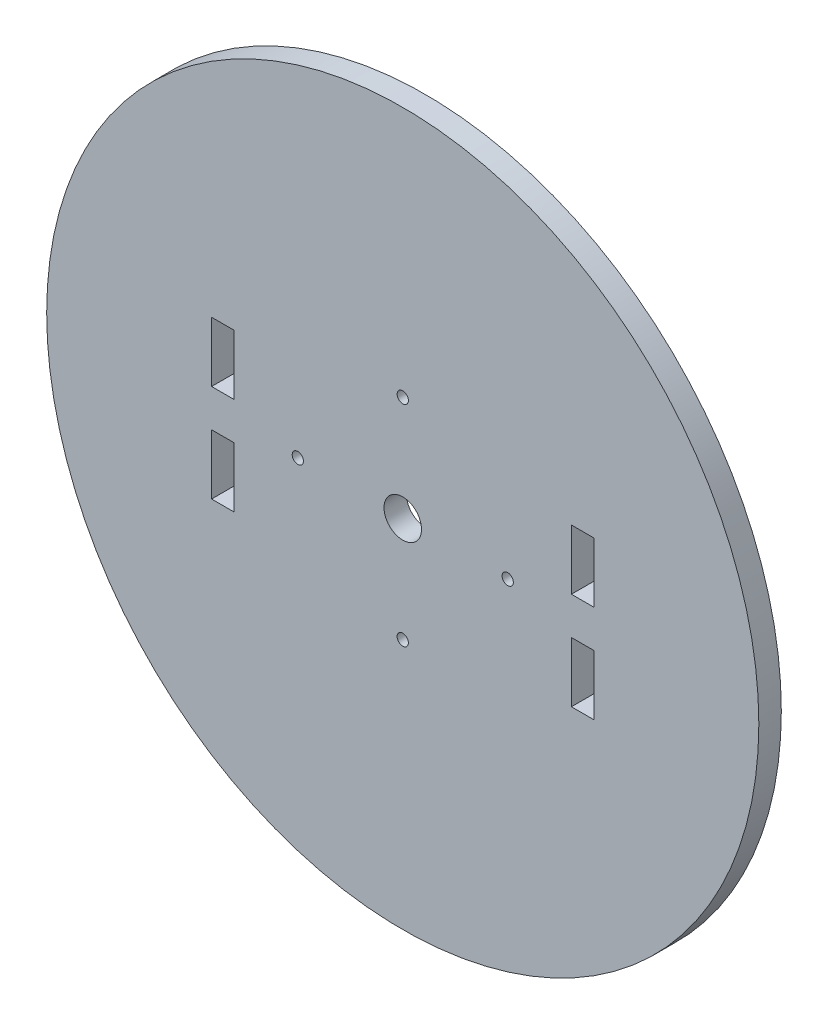
ISO-10303-21;
HEADER;
FILE_DESCRIPTION(('STEP AP214'),'2;1');
FILE_NAME('part.step','',(''),(''),'','','');
FILE_SCHEMA(('AUTOMOTIVE_DESIGN { 1 0 10303 214 1 1 1 1 }'));
ENDSEC;
DATA;
#1=APPLICATION_CONTEXT('core data for automotive mechanical design processes');
#2=APPLICATION_PROTOCOL_DEFINITION('international standard','automotive_design',2000,#1);
#3=PRODUCT_CONTEXT('',#1,'mechanical');
#4=PRODUCT('Part','Part','',(#3));
#5=PRODUCT_RELATED_PRODUCT_CATEGORY('part','',(#4));
#6=PRODUCT_DEFINITION_FORMATION('','',#4);
#7=PRODUCT_DEFINITION_CONTEXT('part definition',#1,'design');
#8=PRODUCT_DEFINITION('design','',#6,#7);
#9=PRODUCT_DEFINITION_SHAPE('','',#8);
#10=(LENGTH_UNIT() NAMED_UNIT(*) SI_UNIT(.MILLI.,.METRE.));
#11=(NAMED_UNIT(*) PLANE_ANGLE_UNIT() SI_UNIT($,.RADIAN.));
#12=(NAMED_UNIT(*) SI_UNIT($,.STERADIAN.) SOLID_ANGLE_UNIT());
#13=UNCERTAINTY_MEASURE_WITH_UNIT(LENGTH_MEASURE(1.E-05),#10,'distance_accuracy_value','');
#14=(GEOMETRIC_REPRESENTATION_CONTEXT(3) GLOBAL_UNCERTAINTY_ASSIGNED_CONTEXT((#13)) GLOBAL_UNIT_ASSIGNED_CONTEXT((#10,
#11,#12)) REPRESENTATION_CONTEXT('',''));
#15=CARTESIAN_POINT('',(0.,0.,0.));
#16=DIRECTION('',(0.,0.,1.));
#17=DIRECTION('',(1.,0.,0.));
#18=AXIS2_PLACEMENT_3D('',#15,#16,#17);
#19=CARTESIAN_POINT('',(0.,0.,3.));
#20=DIRECTION('',(0.,0.,1.));
#21=DIRECTION('',(1.,0.,0.));
#22=AXIS2_PLACEMENT_3D('',#19,#20,#21);
#23=PLANE('',#22);
#24=DIRECTION('',(-1.,0.,0.));
#25=VECTOR('',#24,1.);
#26=CARTESIAN_POINT('',(-22.5,10.5,3.));
#27=LINE('',#26,#25);
#28=CARTESIAN_POINT('',(-22.5,10.5,3.));
#29=VERTEX_POINT('',#28);
#30=CARTESIAN_POINT('',(-25.5,10.5,3.));
#31=VERTEX_POINT('',#30);
#32=EDGE_CURVE('E54',#29,#31,#27,.T.);
#33=ORIENTED_EDGE('',*,*,#32,.F.);
#34=DIRECTION('',(0.,1.,0.));
#35=VECTOR('',#34,1.);
#36=CARTESIAN_POINT('',(-22.5,10.5,3.));
#37=LINE('',#36,#35);
#38=CARTESIAN_POINT('',(-22.5,2.5,3.));
#39=VERTEX_POINT('',#38);
#40=EDGE_CURVE('E256',#39,#29,#37,.T.);
#41=ORIENTED_EDGE('',*,*,#40,.F.);
#42=DIRECTION('',(1.,0.,0.));
#43=VECTOR('',#42,1.);
#44=CARTESIAN_POINT('',(-22.5,2.5,3.));
#45=LINE('',#44,#43);
#46=CARTESIAN_POINT('',(-25.5,2.5,3.));
#47=VERTEX_POINT('',#46);
#48=EDGE_CURVE('E275',#47,#39,#45,.T.);
#49=ORIENTED_EDGE('',*,*,#48,.F.);
#50=DIRECTION('',(0.,-1.,0.));
#51=VECTOR('',#50,1.);
#52=CARTESIAN_POINT('',(-25.5,10.5,3.));
#53=LINE('',#52,#51);
#54=EDGE_CURVE('E271',#31,#47,#53,.T.);
#55=ORIENTED_EDGE('',*,*,#54,.F.);
#56=EDGE_LOOP('',(#33,#41,#49,#55));
#57=FACE_BOUND('',#56,.T.);
#58=DIRECTION('',(-1.,0.,0.));
#59=VECTOR('',#58,1.);
#60=CARTESIAN_POINT('',(-22.5,-2.5,3.));
#61=LINE('',#60,#59);
#62=CARTESIAN_POINT('',(-22.5,-2.5,3.));
#63=VERTEX_POINT('',#62);
#64=CARTESIAN_POINT('',(-25.5,-2.5,3.));
#65=VERTEX_POINT('',#64);
#66=EDGE_CURVE('E62',#63,#65,#61,.T.);
#67=ORIENTED_EDGE('',*,*,#66,.F.);
#68=DIRECTION('',(0.,1.,0.));
#69=VECTOR('',#68,1.);
#70=CARTESIAN_POINT('',(-22.5,-2.5,3.));
#71=LINE('',#70,#69);
#72=CARTESIAN_POINT('',(-22.5,-10.5,3.));
#73=VERTEX_POINT('',#72);
#74=EDGE_CURVE('E214',#73,#63,#71,.T.);
#75=ORIENTED_EDGE('',*,*,#74,.F.);
#76=DIRECTION('',(1.,0.,0.));
#77=VECTOR('',#76,1.);
#78=CARTESIAN_POINT('',(-22.5,-10.5,3.));
#79=LINE('',#78,#77);
#80=CARTESIAN_POINT('',(-25.5,-10.5,3.));
#81=VERTEX_POINT('',#80);
#82=EDGE_CURVE('E234',#81,#73,#79,.T.);
#83=ORIENTED_EDGE('',*,*,#82,.F.);
#84=DIRECTION('',(0.,-1.,0.));
#85=VECTOR('',#84,1.);
#86=CARTESIAN_POINT('',(-25.5,-2.5,3.));
#87=LINE('',#86,#85);
#88=EDGE_CURVE('E229',#65,#81,#87,.T.);
#89=ORIENTED_EDGE('',*,*,#88,.F.);
#90=EDGE_LOOP('',(#67,#75,#83,#89));
#91=FACE_BOUND('',#90,.T.);
#92=DIRECTION('',(0.,-1.,0.));
#93=VECTOR('',#92,1.);
#94=CARTESIAN_POINT('',(22.5,-2.5,3.));
#95=LINE('',#94,#93);
#96=CARTESIAN_POINT('',(22.5,-2.5,3.));
#97=VERTEX_POINT('',#96);
#98=CARTESIAN_POINT('',(22.5,-10.5,3.));
#99=VERTEX_POINT('',#98);
#100=EDGE_CURVE('E159',#97,#99,#95,.T.);
#101=ORIENTED_EDGE('',*,*,#100,.F.);
#102=DIRECTION('',(-1.,0.,0.));
#103=VECTOR('',#102,1.);
#104=CARTESIAN_POINT('',(22.5,-2.5,3.));
#105=LINE('',#104,#103);
#106=CARTESIAN_POINT('',(25.5,-2.5,3.));
#107=VERTEX_POINT('',#106);
#108=EDGE_CURVE('E180',#107,#97,#105,.T.);
#109=ORIENTED_EDGE('',*,*,#108,.F.);
#110=DIRECTION('',(0.,1.,0.));
#111=VECTOR('',#110,1.);
#112=CARTESIAN_POINT('',(25.5,-2.5,3.));
#113=LINE('',#112,#111);
#114=CARTESIAN_POINT('',(25.5,-10.5,3.));
#115=VERTEX_POINT('',#114);
#116=EDGE_CURVE('E184',#115,#107,#113,.T.);
#117=ORIENTED_EDGE('',*,*,#116,.F.);
#118=DIRECTION('',(1.,0.,0.));
#119=VECTOR('',#118,1.);
#120=CARTESIAN_POINT('',(22.5,-10.5,3.));
#121=LINE('',#120,#119);
#122=EDGE_CURVE('E193',#99,#115,#121,.T.);
#123=ORIENTED_EDGE('',*,*,#122,.F.);
#124=EDGE_LOOP('',(#101,#109,#117,#123));
#125=FACE_BOUND('',#124,.T.);
#126=DIRECTION('',(0.,-1.,0.));
#127=VECTOR('',#126,1.);
#128=CARTESIAN_POINT('',(22.5,10.5,3.));
#129=LINE('',#128,#127);
#130=CARTESIAN_POINT('',(22.5,10.5,3.));
#131=VERTEX_POINT('',#130);
#132=CARTESIAN_POINT('',(22.5,2.5,3.));
#133=VERTEX_POINT('',#132);
#134=EDGE_CURVE('E203',#131,#133,#129,.T.);
#135=ORIENTED_EDGE('',*,*,#134,.F.);
#136=DIRECTION('',(-1.,0.,0.));
#137=VECTOR('',#136,1.);
#138=CARTESIAN_POINT('',(22.5,10.5,3.));
#139=LINE('',#138,#137);
#140=CARTESIAN_POINT('',(25.5,10.5,3.));
#141=VERTEX_POINT('',#140);
#142=EDGE_CURVE('E297',#141,#131,#139,.T.);
#143=ORIENTED_EDGE('',*,*,#142,.F.);
#144=DIRECTION('',(0.,1.,0.));
#145=VECTOR('',#144,1.);
#146=CARTESIAN_POINT('',(25.5,10.5,3.));
#147=LINE('',#146,#145);
#148=CARTESIAN_POINT('',(25.5,2.5,3.));
#149=VERTEX_POINT('',#148);
#150=EDGE_CURVE('E316',#149,#141,#147,.T.);
#151=ORIENTED_EDGE('',*,*,#150,.F.);
#152=DIRECTION('',(1.,0.,0.));
#153=VECTOR('',#152,1.);
#154=CARTESIAN_POINT('',(22.5,2.5,3.));
#155=LINE('',#154,#153);
#156=EDGE_CURVE('E312',#133,#149,#155,.T.);
#157=ORIENTED_EDGE('',*,*,#156,.F.);
#158=EDGE_LOOP('',(#135,#143,#151,#157));
#159=FACE_BOUND('',#158,.T.);
#160=CARTESIAN_POINT('',(0.,14.,3.));
#161=DIRECTION('',(0.,0.,1.));
#162=DIRECTION('',(1.,0.,0.));
#163=AXIS2_PLACEMENT_3D('',#160,#161,#162);
#164=CIRCLE('',#163,0.75);
#165=CARTESIAN_POINT('',(0.750000000000098,14.,3.));
#166=VERTEX_POINT('',#165);
#167=EDGE_CURVE('E344',#166,#166,#164,.T.);
#168=ORIENTED_EDGE('',*,*,#167,.F.);
#169=EDGE_LOOP('',(#168));
#170=FACE_BOUND('',#169,.T.);
#171=CARTESIAN_POINT('',(0.,-14.,3.));
#172=DIRECTION('',(0.,0.,1.));
#173=DIRECTION('',(1.,0.,0.));
#174=AXIS2_PLACEMENT_3D('',#171,#172,#173);
#175=CIRCLE('',#174,0.75);
#176=CARTESIAN_POINT('',(0.75,-14.,3.));
#177=VERTEX_POINT('',#176);
#178=EDGE_CURVE('E360',#177,#177,#175,.T.);
#179=ORIENTED_EDGE('',*,*,#178,.F.);
#180=EDGE_LOOP('',(#179));
#181=FACE_BOUND('',#180,.T.);
#182=CARTESIAN_POINT('',(0.,0.,3.));
#183=DIRECTION('',(0.,0.,1.));
#184=DIRECTION('',(1.,0.,0.));
#185=AXIS2_PLACEMENT_3D('',#182,#183,#184);
#186=CIRCLE('',#185,47.5);
#187=CARTESIAN_POINT('',(47.5,0.,3.));
#188=VERTEX_POINT('',#187);
#189=EDGE_CURVE('E11',#188,#188,#186,.T.);
#190=ORIENTED_EDGE('',*,*,#189,.T.);
#191=EDGE_LOOP('',(#190));
#192=FACE_BOUND('',#191,.T.);
#193=CARTESIAN_POINT('',(0.,0.,3.));
#194=DIRECTION('',(0.,0.,1.));
#195=DIRECTION('',(1.,0.,0.));
#196=AXIS2_PLACEMENT_3D('',#193,#194,#195);
#197=CIRCLE('',#196,2.5);
#198=CARTESIAN_POINT('',(2.5,0.,3.));
#199=VERTEX_POINT('',#198);
#200=EDGE_CURVE('E368',#199,#199,#197,.T.);
#201=ORIENTED_EDGE('',*,*,#200,.F.);
#202=EDGE_LOOP('',(#201));
#203=FACE_BOUND('',#202,.T.);
#204=CARTESIAN_POINT('',(-14.,0.,3.));
#205=DIRECTION('',(0.,0.,1.));
#206=DIRECTION('',(1.,0.,0.));
#207=AXIS2_PLACEMENT_3D('',#204,#205,#206);
#208=CIRCLE('',#207,0.75);
#209=CARTESIAN_POINT('',(-13.25,0.,3.));
#210=VERTEX_POINT('',#209);
#211=EDGE_CURVE('E352',#210,#210,#208,.T.);
#212=ORIENTED_EDGE('',*,*,#211,.F.);
#213=EDGE_LOOP('',(#212));
#214=FACE_BOUND('',#213,.T.);
#215=CARTESIAN_POINT('',(14.,-1.46642216231412E-13,3.));
#216=DIRECTION('',(0.,0.,1.));
#217=DIRECTION('',(1.,0.,0.));
#218=AXIS2_PLACEMENT_3D('',#215,#216,#217);
#219=CIRCLE('',#218,0.75);
#220=CARTESIAN_POINT('',(14.75,-1.46642216231412E-13,3.));
#221=VERTEX_POINT('',#220);
#222=EDGE_CURVE('E336',#221,#221,#219,.T.);
#223=ORIENTED_EDGE('',*,*,#222,.F.);
#224=EDGE_LOOP('',(#223));
#225=FACE_BOUND('',#224,.T.);
#226=ADVANCED_FACE('F38',(#57,#91,#125,#159,#170,#181,#192,#203,#214,#225),#23,.T.);
#227=CARTESIAN_POINT('',(0.,0.,0.));
#228=DIRECTION('',(0.,0.,1.));
#229=DIRECTION('',(1.,0.,0.));
#230=AXIS2_PLACEMENT_3D('',#227,#228,#229);
#231=PLANE('',#230);
#232=DIRECTION('',(0.,1.,0.));
#233=VECTOR('',#232,1.);
#234=CARTESIAN_POINT('',(-22.5,10.5,0.));
#235=LINE('',#234,#233);
#236=CARTESIAN_POINT('',(-22.5,2.5,0.));
#237=VERTEX_POINT('',#236);
#238=CARTESIAN_POINT('',(-22.5,10.5,0.));
#239=VERTEX_POINT('',#238);
#240=EDGE_CURVE('E264',#237,#239,#235,.T.);
#241=ORIENTED_EDGE('',*,*,#240,.T.);
#242=DIRECTION('',(-1.,0.,0.));
#243=VECTOR('',#242,1.);
#244=CARTESIAN_POINT('',(-22.5,10.5,0.));
#245=LINE('',#244,#243);
#246=CARTESIAN_POINT('',(-25.5,10.5,0.));
#247=VERTEX_POINT('',#246);
#248=EDGE_CURVE('E251',#239,#247,#245,.T.);
#249=ORIENTED_EDGE('',*,*,#248,.T.);
#250=DIRECTION('',(0.,-1.,0.));
#251=VECTOR('',#250,1.);
#252=CARTESIAN_POINT('',(-25.5,10.5,0.));
#253=LINE('',#252,#251);
#254=CARTESIAN_POINT('',(-25.5,2.5,0.));
#255=VERTEX_POINT('',#254);
#256=EDGE_CURVE('E255',#247,#255,#253,.T.);
#257=ORIENTED_EDGE('',*,*,#256,.T.);
#258=DIRECTION('',(1.,0.,0.));
#259=VECTOR('',#258,1.);
#260=CARTESIAN_POINT('',(-22.5,2.5,0.));
#261=LINE('',#260,#259);
#262=EDGE_CURVE('E260',#255,#237,#261,.T.);
#263=ORIENTED_EDGE('',*,*,#262,.T.);
#264=EDGE_LOOP('',(#241,#249,#257,#263));
#265=FACE_BOUND('',#264,.T.);
#266=DIRECTION('',(0.,1.,0.));
#267=VECTOR('',#266,1.);
#268=CARTESIAN_POINT('',(-22.5,-2.5,0.));
#269=LINE('',#268,#267);
#270=CARTESIAN_POINT('',(-22.5,-10.5,0.));
#271=VERTEX_POINT('',#270);
#272=CARTESIAN_POINT('',(-22.5,-2.5,0.));
#273=VERTEX_POINT('',#272);
#274=EDGE_CURVE('E222',#271,#273,#269,.T.);
#275=ORIENTED_EDGE('',*,*,#274,.T.);
#276=DIRECTION('',(-1.,0.,0.));
#277=VECTOR('',#276,1.);
#278=CARTESIAN_POINT('',(-22.5,-2.5,0.));
#279=LINE('',#278,#277);
#280=CARTESIAN_POINT('',(-25.5,-2.5,0.));
#281=VERTEX_POINT('',#280);
#282=EDGE_CURVE('E209',#273,#281,#279,.T.);
#283=ORIENTED_EDGE('',*,*,#282,.T.);
#284=DIRECTION('',(0.,-1.,0.));
#285=VECTOR('',#284,1.);
#286=CARTESIAN_POINT('',(-25.5,-2.5,0.));
#287=LINE('',#286,#285);
#288=CARTESIAN_POINT('',(-25.5,-10.5,0.));
#289=VERTEX_POINT('',#288);
#290=EDGE_CURVE('E213',#281,#289,#287,.T.);
#291=ORIENTED_EDGE('',*,*,#290,.T.);
#292=DIRECTION('',(1.,0.,0.));
#293=VECTOR('',#292,1.);
#294=CARTESIAN_POINT('',(-22.5,-10.5,0.));
#295=LINE('',#294,#293);
#296=EDGE_CURVE('E218',#289,#271,#295,.T.);
#297=ORIENTED_EDGE('',*,*,#296,.T.);
#298=EDGE_LOOP('',(#275,#283,#291,#297));
#299=FACE_BOUND('',#298,.T.);
#300=DIRECTION('',(-1.,0.,0.));
#301=VECTOR('',#300,1.);
#302=CARTESIAN_POINT('',(22.5,-2.5,0.));
#303=LINE('',#302,#301);
#304=CARTESIAN_POINT('',(25.5,-2.5,0.));
#305=VERTEX_POINT('',#304);
#306=CARTESIAN_POINT('',(22.5,-2.5,0.));
#307=VERTEX_POINT('',#306);
#308=EDGE_CURVE('E165',#305,#307,#303,.T.);
#309=ORIENTED_EDGE('',*,*,#308,.T.);
#310=DIRECTION('',(0.,-1.,0.));
#311=VECTOR('',#310,1.);
#312=CARTESIAN_POINT('',(22.5,-2.5,0.));
#313=LINE('',#312,#311);
#314=CARTESIAN_POINT('',(22.5,-10.5,0.));
#315=VERTEX_POINT('',#314);
#316=EDGE_CURVE('E156',#307,#315,#313,.T.);
#317=ORIENTED_EDGE('',*,*,#316,.T.);
#318=DIRECTION('',(1.,0.,0.));
#319=VECTOR('',#318,1.);
#320=CARTESIAN_POINT('',(22.5,-10.5,0.));
#321=LINE('',#320,#319);
#322=CARTESIAN_POINT('',(25.5,-10.5,0.));
#323=VERTEX_POINT('',#322);
#324=EDGE_CURVE('E169',#315,#323,#321,.T.);
#325=ORIENTED_EDGE('',*,*,#324,.T.);
#326=DIRECTION('',(0.,1.,0.));
#327=VECTOR('',#326,1.);
#328=CARTESIAN_POINT('',(25.5,-2.5,0.));
#329=LINE('',#328,#327);
#330=EDGE_CURVE('E174',#323,#305,#329,.T.);
#331=ORIENTED_EDGE('',*,*,#330,.T.);
#332=EDGE_LOOP('',(#309,#317,#325,#331));
#333=FACE_BOUND('',#332,.T.);
#334=DIRECTION('',(-1.,0.,0.));
#335=VECTOR('',#334,1.);
#336=CARTESIAN_POINT('',(22.5,10.5,0.));
#337=LINE('',#336,#335);
#338=CARTESIAN_POINT('',(25.5,10.5,0.));
#339=VERTEX_POINT('',#338);
#340=CARTESIAN_POINT('',(22.5,10.5,0.));
#341=VERTEX_POINT('',#340);
#342=EDGE_CURVE('E305',#339,#341,#337,.T.);
#343=ORIENTED_EDGE('',*,*,#342,.T.);
#344=DIRECTION('',(0.,-1.,0.));
#345=VECTOR('',#344,1.);
#346=CARTESIAN_POINT('',(22.5,10.5,0.));
#347=LINE('',#346,#345);
#348=CARTESIAN_POINT('',(22.5,2.5,0.));
#349=VERTEX_POINT('',#348);
#350=EDGE_CURVE('E292',#341,#349,#347,.T.);
#351=ORIENTED_EDGE('',*,*,#350,.T.);
#352=DIRECTION('',(1.,0.,0.));
#353=VECTOR('',#352,1.);
#354=CARTESIAN_POINT('',(22.5,2.5,0.));
#355=LINE('',#354,#353);
#356=CARTESIAN_POINT('',(25.5,2.5,0.));
#357=VERTEX_POINT('',#356);
#358=EDGE_CURVE('E296',#349,#357,#355,.T.);
#359=ORIENTED_EDGE('',*,*,#358,.T.);
#360=DIRECTION('',(0.,1.,0.));
#361=VECTOR('',#360,1.);
#362=CARTESIAN_POINT('',(25.5,10.5,0.));
#363=LINE('',#362,#361);
#364=EDGE_CURVE('E301',#357,#339,#363,.T.);
#365=ORIENTED_EDGE('',*,*,#364,.T.);
#366=EDGE_LOOP('',(#343,#351,#359,#365));
#367=FACE_BOUND('',#366,.T.);
#368=CARTESIAN_POINT('',(0.,0.,0.));
#369=DIRECTION('',(0.,0.,1.));
#370=DIRECTION('',(1.,0.,0.));
#371=AXIS2_PLACEMENT_3D('',#368,#369,#370);
#372=CIRCLE('',#371,47.5);
#373=CARTESIAN_POINT('',(47.5,0.,0.));
#374=VERTEX_POINT('',#373);
#375=EDGE_CURVE('E42',#374,#374,#372,.T.);
#376=ORIENTED_EDGE('',*,*,#375,.F.);
#377=EDGE_LOOP('',(#376));
#378=FACE_BOUND('',#377,.T.);
#379=CARTESIAN_POINT('',(0.,0.,0.));
#380=DIRECTION('',(0.,0.,1.));
#381=DIRECTION('',(1.,0.,0.));
#382=AXIS2_PLACEMENT_3D('',#379,#380,#381);
#383=CIRCLE('',#382,2.5);
#384=CARTESIAN_POINT('',(2.5,0.,0.));
#385=VERTEX_POINT('',#384);
#386=EDGE_CURVE('E364',#385,#385,#383,.T.);
#387=ORIENTED_EDGE('',*,*,#386,.T.);
#388=EDGE_LOOP('',(#387));
#389=FACE_BOUND('',#388,.T.);
#390=CARTESIAN_POINT('',(0.,-14.,0.));
#391=DIRECTION('',(0.,0.,1.));
#392=DIRECTION('',(1.,0.,0.));
#393=AXIS2_PLACEMENT_3D('',#390,#391,#392);
#394=CIRCLE('',#393,0.75);
#395=CARTESIAN_POINT('',(0.75,-14.,0.));
#396=VERTEX_POINT('',#395);
#397=EDGE_CURVE('E356',#396,#396,#394,.T.);
#398=ORIENTED_EDGE('',*,*,#397,.T.);
#399=EDGE_LOOP('',(#398));
#400=FACE_BOUND('',#399,.T.);
#401=CARTESIAN_POINT('',(-14.,0.,0.));
#402=DIRECTION('',(0.,0.,1.));
#403=DIRECTION('',(1.,0.,0.));
#404=AXIS2_PLACEMENT_3D('',#401,#402,#403);
#405=CIRCLE('',#404,0.75);
#406=CARTESIAN_POINT('',(-13.25,0.,0.));
#407=VERTEX_POINT('',#406);
#408=EDGE_CURVE('E348',#407,#407,#405,.T.);
#409=ORIENTED_EDGE('',*,*,#408,.T.);
#410=EDGE_LOOP('',(#409));
#411=FACE_BOUND('',#410,.T.);
#412=CARTESIAN_POINT('',(0.,14.,0.));
#413=DIRECTION('',(0.,0.,1.));
#414=DIRECTION('',(1.,0.,0.));
#415=AXIS2_PLACEMENT_3D('',#412,#413,#414);
#416=CIRCLE('',#415,0.75);
#417=CARTESIAN_POINT('',(0.750000000000098,14.,0.));
#418=VERTEX_POINT('',#417);
#419=EDGE_CURVE('E340',#418,#418,#416,.T.);
#420=ORIENTED_EDGE('',*,*,#419,.T.);
#421=EDGE_LOOP('',(#420));
#422=FACE_BOUND('',#421,.T.);
#423=CARTESIAN_POINT('',(14.,-1.46642216231412E-13,0.));
#424=DIRECTION('',(0.,0.,1.));
#425=DIRECTION('',(1.,0.,0.));
#426=AXIS2_PLACEMENT_3D('',#423,#424,#425);
#427=CIRCLE('',#426,0.75);
#428=CARTESIAN_POINT('',(14.75,-1.46642216231412E-13,0.));
#429=VERTEX_POINT('',#428);
#430=EDGE_CURVE('E326',#429,#429,#427,.T.);
#431=ORIENTED_EDGE('',*,*,#430,.T.);
#432=EDGE_LOOP('',(#431));
#433=FACE_BOUND('',#432,.T.);
#434=ADVANCED_FACE('F176',(#265,#299,#333,#367,#378,#389,#400,#411,#422,#433),#231,.F.);
#435=CARTESIAN_POINT('',(0.,0.,3.));
#436=DIRECTION('',(0.,0.,-1.));
#437=DIRECTION('',(-1.,0.,0.));
#438=AXIS2_PLACEMENT_3D('',#435,#436,#437);
#439=CYLINDRICAL_SURFACE('',#438,47.5);
#440=ORIENTED_EDGE('',*,*,#189,.F.);
#441=EDGE_LOOP('',(#440));
#442=FACE_BOUND('',#441,.T.);
#443=ORIENTED_EDGE('',*,*,#375,.T.);
#444=EDGE_LOOP('',(#443));
#445=FACE_BOUND('',#444,.T.);
#446=ADVANCED_FACE('F40',(#442,#445),#439,.T.);
#447=CARTESIAN_POINT('',(0.,0.,3.));
#448=DIRECTION('',(0.,0.,-1.));
#449=DIRECTION('',(-1.,0.,0.));
#450=AXIS2_PLACEMENT_3D('',#447,#448,#449);
#451=CYLINDRICAL_SURFACE('',#450,2.5);
#452=ORIENTED_EDGE('',*,*,#200,.T.);
#453=EDGE_LOOP('',(#452));
#454=FACE_BOUND('',#453,.T.);
#455=ORIENTED_EDGE('',*,*,#386,.F.);
#456=EDGE_LOOP('',(#455));
#457=FACE_BOUND('',#456,.T.);
#458=ADVANCED_FACE('F378',(#454,#457),#451,.F.);
#459=CARTESIAN_POINT('',(0.,-14.,3.));
#460=DIRECTION('',(0.,0.,-1.));
#461=DIRECTION('',(-1.,0.,0.));
#462=AXIS2_PLACEMENT_3D('',#459,#460,#461);
#463=CYLINDRICAL_SURFACE('',#462,0.75);
#464=ORIENTED_EDGE('',*,*,#178,.T.);
#465=EDGE_LOOP('',(#464));
#466=FACE_BOUND('',#465,.T.);
#467=ORIENTED_EDGE('',*,*,#397,.F.);
#468=EDGE_LOOP('',(#467));
#469=FACE_BOUND('',#468,.T.);
#470=ADVANCED_FACE('F380',(#466,#469),#463,.F.);
#471=CARTESIAN_POINT('',(-14.,0.,3.));
#472=DIRECTION('',(0.,0.,-1.));
#473=DIRECTION('',(-1.,0.,0.));
#474=AXIS2_PLACEMENT_3D('',#471,#472,#473);
#475=CYLINDRICAL_SURFACE('',#474,0.75);
#476=ORIENTED_EDGE('',*,*,#211,.T.);
#477=EDGE_LOOP('',(#476));
#478=FACE_BOUND('',#477,.T.);
#479=ORIENTED_EDGE('',*,*,#408,.F.);
#480=EDGE_LOOP('',(#479));
#481=FACE_BOUND('',#480,.T.);
#482=ADVANCED_FACE('F387',(#478,#481),#475,.F.);
#483=CARTESIAN_POINT('',(0.,14.,3.));
#484=DIRECTION('',(0.,0.,-1.));
#485=DIRECTION('',(-1.,0.,0.));
#486=AXIS2_PLACEMENT_3D('',#483,#484,#485);
#487=CYLINDRICAL_SURFACE('',#486,0.75);
#488=ORIENTED_EDGE('',*,*,#167,.T.);
#489=EDGE_LOOP('',(#488));
#490=FACE_BOUND('',#489,.T.);
#491=ORIENTED_EDGE('',*,*,#419,.F.);
#492=EDGE_LOOP('',(#491));
#493=FACE_BOUND('',#492,.T.);
#494=ADVANCED_FACE('F427',(#490,#493),#487,.F.);
#495=CARTESIAN_POINT('',(14.,-1.46642216231412E-13,3.));
#496=DIRECTION('',(0.,0.,-1.));
#497=DIRECTION('',(-1.,0.,0.));
#498=AXIS2_PLACEMENT_3D('',#495,#496,#497);
#499=CYLINDRICAL_SURFACE('',#498,0.75);
#500=ORIENTED_EDGE('',*,*,#222,.T.);
#501=EDGE_LOOP('',(#500));
#502=FACE_BOUND('',#501,.T.);
#503=ORIENTED_EDGE('',*,*,#430,.F.);
#504=EDGE_LOOP('',(#503));
#505=FACE_BOUND('',#504,.T.);
#506=ADVANCED_FACE('F423',(#502,#505),#499,.F.);
#507=CARTESIAN_POINT('',(22.5,10.5,0.));
#508=DIRECTION('',(-1.,0.,0.));
#509=DIRECTION('',(0.,0.,1.));
#510=AXIS2_PLACEMENT_3D('',#507,#508,#509);
#511=PLANE('',#510);
#512=ORIENTED_EDGE('',*,*,#134,.T.);
#513=DIRECTION('',(0.,0.,1.));
#514=VECTOR('',#513,1.);
#515=CARTESIAN_POINT('',(22.5,2.5,0.));
#516=LINE('',#515,#514);
#517=EDGE_CURVE('E309',#349,#133,#516,.T.);
#518=ORIENTED_EDGE('',*,*,#517,.F.);
#519=ORIENTED_EDGE('',*,*,#350,.F.);
#520=DIRECTION('',(0.,0.,1.));
#521=VECTOR('',#520,1.);
#522=CARTESIAN_POINT('',(22.5,10.5,0.));
#523=LINE('',#522,#521);
#524=EDGE_CURVE('E323',#341,#131,#523,.T.);
#525=ORIENTED_EDGE('',*,*,#524,.T.);
#526=EDGE_LOOP('',(#512,#518,#519,#525));
#527=FACE_BOUND('',#526,.T.);
#528=ADVANCED_FACE('F426',(#527),#511,.F.);
#529=CARTESIAN_POINT('',(22.5,10.5,0.));
#530=DIRECTION('',(0.,1.,0.));
#531=DIRECTION('',(0.,0.,1.));
#532=AXIS2_PLACEMENT_3D('',#529,#530,#531);
#533=PLANE('',#532);
#534=ORIENTED_EDGE('',*,*,#142,.T.);
#535=ORIENTED_EDGE('',*,*,#524,.F.);
#536=ORIENTED_EDGE('',*,*,#342,.F.);
#537=DIRECTION('',(0.,0.,1.));
#538=VECTOR('',#537,1.);
#539=CARTESIAN_POINT('',(25.5,10.5,0.));
#540=LINE('',#539,#538);
#541=EDGE_CURVE('E327',#339,#141,#540,.T.);
#542=ORIENTED_EDGE('',*,*,#541,.T.);
#543=EDGE_LOOP('',(#534,#535,#536,#542));
#544=FACE_BOUND('',#543,.T.);
#545=ADVANCED_FACE('F434',(#544),#533,.F.);
#546=CARTESIAN_POINT('',(25.5,10.5,0.));
#547=DIRECTION('',(1.,0.,0.));
#548=DIRECTION('',(0.,1.,0.));
#549=AXIS2_PLACEMENT_3D('',#546,#547,#548);
#550=PLANE('',#549);
#551=ORIENTED_EDGE('',*,*,#150,.T.);
#552=ORIENTED_EDGE('',*,*,#541,.F.);
#553=ORIENTED_EDGE('',*,*,#364,.F.);
#554=DIRECTION('',(0.,0.,1.));
#555=VECTOR('',#554,1.);
#556=CARTESIAN_POINT('',(25.5,2.5,0.));
#557=LINE('',#556,#555);
#558=EDGE_CURVE('E330',#357,#149,#557,.T.);
#559=ORIENTED_EDGE('',*,*,#558,.T.);
#560=EDGE_LOOP('',(#551,#552,#553,#559));
#561=FACE_BOUND('',#560,.T.);
#562=ADVANCED_FACE('F476',(#561),#550,.F.);
#563=CARTESIAN_POINT('',(22.5,2.5,0.));
#564=DIRECTION('',(0.,-1.,0.));
#565=DIRECTION('',(1.,0.,0.));
#566=AXIS2_PLACEMENT_3D('',#563,#564,#565);
#567=PLANE('',#566);
#568=ORIENTED_EDGE('',*,*,#156,.T.);
#569=ORIENTED_EDGE('',*,*,#558,.F.);
#570=ORIENTED_EDGE('',*,*,#358,.F.);
#571=ORIENTED_EDGE('',*,*,#517,.T.);
#572=EDGE_LOOP('',(#568,#569,#570,#571));
#573=FACE_BOUND('',#572,.T.);
#574=ADVANCED_FACE('F485',(#573),#567,.F.);
#575=CARTESIAN_POINT('',(22.5,-2.5,0.));
#576=DIRECTION('',(-1.,0.,0.));
#577=DIRECTION('',(0.,0.,1.));
#578=AXIS2_PLACEMENT_3D('',#575,#576,#577);
#579=PLANE('',#578);
#580=ORIENTED_EDGE('',*,*,#100,.T.);
#581=DIRECTION('',(0.,0.,1.));
#582=VECTOR('',#581,1.);
#583=CARTESIAN_POINT('',(22.5,-10.5,0.));
#584=LINE('',#583,#582);
#585=EDGE_CURVE('E152',#315,#99,#584,.T.);
#586=ORIENTED_EDGE('',*,*,#585,.F.);
#587=ORIENTED_EDGE('',*,*,#316,.F.);
#588=DIRECTION('',(0.,0.,1.));
#589=VECTOR('',#588,1.);
#590=CARTESIAN_POINT('',(22.5,-2.5,0.));
#591=LINE('',#590,#589);
#592=EDGE_CURVE('E200',#307,#97,#591,.T.);
#593=ORIENTED_EDGE('',*,*,#592,.T.);
#594=EDGE_LOOP('',(#580,#586,#587,#593));
#595=FACE_BOUND('',#594,.T.);
#596=ADVANCED_FACE('F154',(#595),#579,.F.);
#597=CARTESIAN_POINT('',(22.5,-2.5,0.));
#598=DIRECTION('',(0.,1.,0.));
#599=DIRECTION('',(-1.,0.,0.));
#600=AXIS2_PLACEMENT_3D('',#597,#598,#599);
#601=PLANE('',#600);
#602=ORIENTED_EDGE('',*,*,#108,.T.);
#603=ORIENTED_EDGE('',*,*,#592,.F.);
#604=ORIENTED_EDGE('',*,*,#308,.F.);
#605=DIRECTION('',(0.,0.,1.));
#606=VECTOR('',#605,1.);
#607=CARTESIAN_POINT('',(25.5,-2.5,0.));
#608=LINE('',#607,#606);
#609=EDGE_CURVE('E204',#305,#107,#608,.T.);
#610=ORIENTED_EDGE('',*,*,#609,.T.);
#611=EDGE_LOOP('',(#602,#603,#604,#610));
#612=FACE_BOUND('',#611,.T.);
#613=ADVANCED_FACE('F501',(#612),#601,.F.);
#614=CARTESIAN_POINT('',(25.5,-2.5,0.));
#615=DIRECTION('',(1.,0.,0.));
#616=DIRECTION('',(0.,1.,0.));
#617=AXIS2_PLACEMENT_3D('',#614,#615,#616);
#618=PLANE('',#617);
#619=ORIENTED_EDGE('',*,*,#116,.T.);
#620=ORIENTED_EDGE('',*,*,#609,.F.);
#621=ORIENTED_EDGE('',*,*,#330,.F.);
#622=DIRECTION('',(0.,0.,1.));
#623=VECTOR('',#622,1.);
#624=CARTESIAN_POINT('',(25.5,-10.5,0.));
#625=LINE('',#624,#623);
#626=EDGE_CURVE('E164',#323,#115,#625,.T.);
#627=ORIENTED_EDGE('',*,*,#626,.T.);
#628=EDGE_LOOP('',(#619,#620,#621,#627));
#629=FACE_BOUND('',#628,.T.);
#630=ADVANCED_FACE('F509',(#629),#618,.F.);
#631=CARTESIAN_POINT('',(22.5,-10.5,0.));
#632=DIRECTION('',(0.,-1.,0.));
#633=DIRECTION('',(0.,0.,-1.));
#634=AXIS2_PLACEMENT_3D('',#631,#632,#633);
#635=PLANE('',#634);
#636=ORIENTED_EDGE('',*,*,#122,.T.);
#637=ORIENTED_EDGE('',*,*,#626,.F.);
#638=ORIENTED_EDGE('',*,*,#324,.F.);
#639=ORIENTED_EDGE('',*,*,#585,.T.);
#640=EDGE_LOOP('',(#636,#637,#638,#639));
#641=FACE_BOUND('',#640,.T.);
#642=ADVANCED_FACE('F170',(#641),#635,.F.);
#643=CARTESIAN_POINT('',(-22.5,-2.5,0.));
#644=DIRECTION('',(0.,1.,0.));
#645=DIRECTION('',(-1.,0.,0.));
#646=AXIS2_PLACEMENT_3D('',#643,#644,#645);
#647=PLANE('',#646);
#648=ORIENTED_EDGE('',*,*,#66,.T.);
#649=DIRECTION('',(0.,0.,1.));
#650=VECTOR('',#649,1.);
#651=CARTESIAN_POINT('',(-25.5,-2.5,0.));
#652=LINE('',#651,#650);
#653=EDGE_CURVE('E226',#281,#65,#652,.T.);
#654=ORIENTED_EDGE('',*,*,#653,.F.);
#655=ORIENTED_EDGE('',*,*,#282,.F.);
#656=DIRECTION('',(0.,0.,1.));
#657=VECTOR('',#656,1.);
#658=CARTESIAN_POINT('',(-22.5,-2.5,0.));
#659=LINE('',#658,#657);
#660=EDGE_CURVE('E194',#273,#63,#659,.T.);
#661=ORIENTED_EDGE('',*,*,#660,.T.);
#662=EDGE_LOOP('',(#648,#654,#655,#661));
#663=FACE_BOUND('',#662,.T.);
#664=ADVANCED_FACE('F526',(#663),#647,.F.);
#665=CARTESIAN_POINT('',(-22.5,-2.5,0.));
#666=DIRECTION('',(1.,0.,0.));
#667=DIRECTION('',(0.,0.,-1.));
#668=AXIS2_PLACEMENT_3D('',#665,#666,#667);
#669=PLANE('',#668);
#670=ORIENTED_EDGE('',*,*,#74,.T.);
#671=ORIENTED_EDGE('',*,*,#660,.F.);
#672=ORIENTED_EDGE('',*,*,#274,.F.);
#673=DIRECTION('',(0.,0.,1.));
#674=VECTOR('',#673,1.);
#675=CARTESIAN_POINT('',(-22.5,-10.5,0.));
#676=LINE('',#675,#674);
#677=EDGE_CURVE('E243',#271,#73,#676,.T.);
#678=ORIENTED_EDGE('',*,*,#677,.T.);
#679=EDGE_LOOP('',(#670,#671,#672,#678));
#680=FACE_BOUND('',#679,.T.);
#681=ADVANCED_FACE('F534',(#680),#669,.F.);
#682=CARTESIAN_POINT('',(-22.5,-10.5,0.));
#683=DIRECTION('',(0.,-1.,0.));
#684=DIRECTION('',(0.,0.,-1.));
#685=AXIS2_PLACEMENT_3D('',#682,#683,#684);
#686=PLANE('',#685);
#687=ORIENTED_EDGE('',*,*,#82,.T.);
#688=ORIENTED_EDGE('',*,*,#677,.F.);
#689=ORIENTED_EDGE('',*,*,#296,.F.);
#690=DIRECTION('',(0.,0.,1.));
#691=VECTOR('',#690,1.);
#692=CARTESIAN_POINT('',(-25.5,-10.5,0.));
#693=LINE('',#692,#691);
#694=EDGE_CURVE('E246',#289,#81,#693,.T.);
#695=ORIENTED_EDGE('',*,*,#694,.T.);
#696=EDGE_LOOP('',(#687,#688,#689,#695));
#697=FACE_BOUND('',#696,.T.);
#698=ADVANCED_FACE('F542',(#697),#686,.F.);
#699=CARTESIAN_POINT('',(-25.5,-2.5,0.));
#700=DIRECTION('',(-1.,0.,0.));
#701=DIRECTION('',(0.,-1.,0.));
#702=AXIS2_PLACEMENT_3D('',#699,#700,#701);
#703=PLANE('',#702);
#704=ORIENTED_EDGE('',*,*,#88,.T.);
#705=ORIENTED_EDGE('',*,*,#694,.F.);
#706=ORIENTED_EDGE('',*,*,#290,.F.);
#707=ORIENTED_EDGE('',*,*,#653,.T.);
#708=EDGE_LOOP('',(#704,#705,#706,#707));
#709=FACE_BOUND('',#708,.T.);
#710=ADVANCED_FACE('F551',(#709),#703,.F.);
#711=CARTESIAN_POINT('',(-22.5,10.5,0.));
#712=DIRECTION('',(0.,1.,0.));
#713=DIRECTION('',(0.,0.,1.));
#714=AXIS2_PLACEMENT_3D('',#711,#712,#713);
#715=PLANE('',#714);
#716=ORIENTED_EDGE('',*,*,#32,.T.);
#717=DIRECTION('',(0.,0.,1.));
#718=VECTOR('',#717,1.);
#719=CARTESIAN_POINT('',(-25.5,10.5,0.));
#720=LINE('',#719,#718);
#721=EDGE_CURVE('E268',#247,#31,#720,.T.);
#722=ORIENTED_EDGE('',*,*,#721,.F.);
#723=ORIENTED_EDGE('',*,*,#248,.F.);
#724=DIRECTION('',(0.,0.,1.));
#725=VECTOR('',#724,1.);
#726=CARTESIAN_POINT('',(-22.5,10.5,0.));
#727=LINE('',#726,#725);
#728=EDGE_CURVE('E230',#239,#29,#727,.T.);
#729=ORIENTED_EDGE('',*,*,#728,.T.);
#730=EDGE_LOOP('',(#716,#722,#723,#729));
#731=FACE_BOUND('',#730,.T.);
#732=ADVANCED_FACE('F560',(#731),#715,.F.);
#733=CARTESIAN_POINT('',(-22.5,10.5,0.));
#734=DIRECTION('',(1.,0.,0.));
#735=DIRECTION('',(0.,0.,-1.));
#736=AXIS2_PLACEMENT_3D('',#733,#734,#735);
#737=PLANE('',#736);
#738=ORIENTED_EDGE('',*,*,#40,.T.);
#739=ORIENTED_EDGE('',*,*,#728,.F.);
#740=ORIENTED_EDGE('',*,*,#240,.F.);
#741=DIRECTION('',(0.,0.,1.));
#742=VECTOR('',#741,1.);
#743=CARTESIAN_POINT('',(-22.5,2.5,0.));
#744=LINE('',#743,#742);
#745=EDGE_CURVE('E284',#237,#39,#744,.T.);
#746=ORIENTED_EDGE('',*,*,#745,.T.);
#747=EDGE_LOOP('',(#738,#739,#740,#746));
#748=FACE_BOUND('',#747,.T.);
#749=ADVANCED_FACE('F569',(#748),#737,.F.);
#750=CARTESIAN_POINT('',(-22.5,2.5,0.));
#751=DIRECTION('',(0.,-1.,0.));
#752=DIRECTION('',(1.,0.,0.));
#753=AXIS2_PLACEMENT_3D('',#750,#751,#752);
#754=PLANE('',#753);
#755=ORIENTED_EDGE('',*,*,#48,.T.);
#756=ORIENTED_EDGE('',*,*,#745,.F.);
#757=ORIENTED_EDGE('',*,*,#262,.F.);
#758=DIRECTION('',(0.,0.,1.));
#759=VECTOR('',#758,1.);
#760=CARTESIAN_POINT('',(-25.5,2.5,0.));
#761=LINE('',#760,#759);
#762=EDGE_CURVE('E287',#255,#47,#761,.T.);
#763=ORIENTED_EDGE('',*,*,#762,.T.);
#764=EDGE_LOOP('',(#755,#756,#757,#763));
#765=FACE_BOUND('',#764,.T.);
#766=ADVANCED_FACE('F577',(#765),#754,.F.);
#767=CARTESIAN_POINT('',(-25.5,10.5,0.));
#768=DIRECTION('',(-1.,0.,0.));
#769=DIRECTION('',(0.,-1.,0.));
#770=AXIS2_PLACEMENT_3D('',#767,#768,#769);
#771=PLANE('',#770);
#772=ORIENTED_EDGE('',*,*,#54,.T.);
#773=ORIENTED_EDGE('',*,*,#762,.F.);
#774=ORIENTED_EDGE('',*,*,#256,.F.);
#775=ORIENTED_EDGE('',*,*,#721,.T.);
#776=EDGE_LOOP('',(#772,#773,#774,#775));
#777=FACE_BOUND('',#776,.T.);
#778=ADVANCED_FACE('F586',(#777),#771,.F.);
#779=CLOSED_SHELL('',(#226,#434,#446,#458,#470,#482,#494,#506,#528,#545,#562,#574,#596,#613,
#630,#642,#664,#681,#698,#710,#732,#749,#766,#778));
#780=MANIFOLD_SOLID_BREP('B2',#779);
#781=ADVANCED_BREP_SHAPE_REPRESENTATION('',(#18,#780),#14);
#782=SHAPE_DEFINITION_REPRESENTATION(#9,#781);
ENDSEC;
END-ISO-10303-21;
